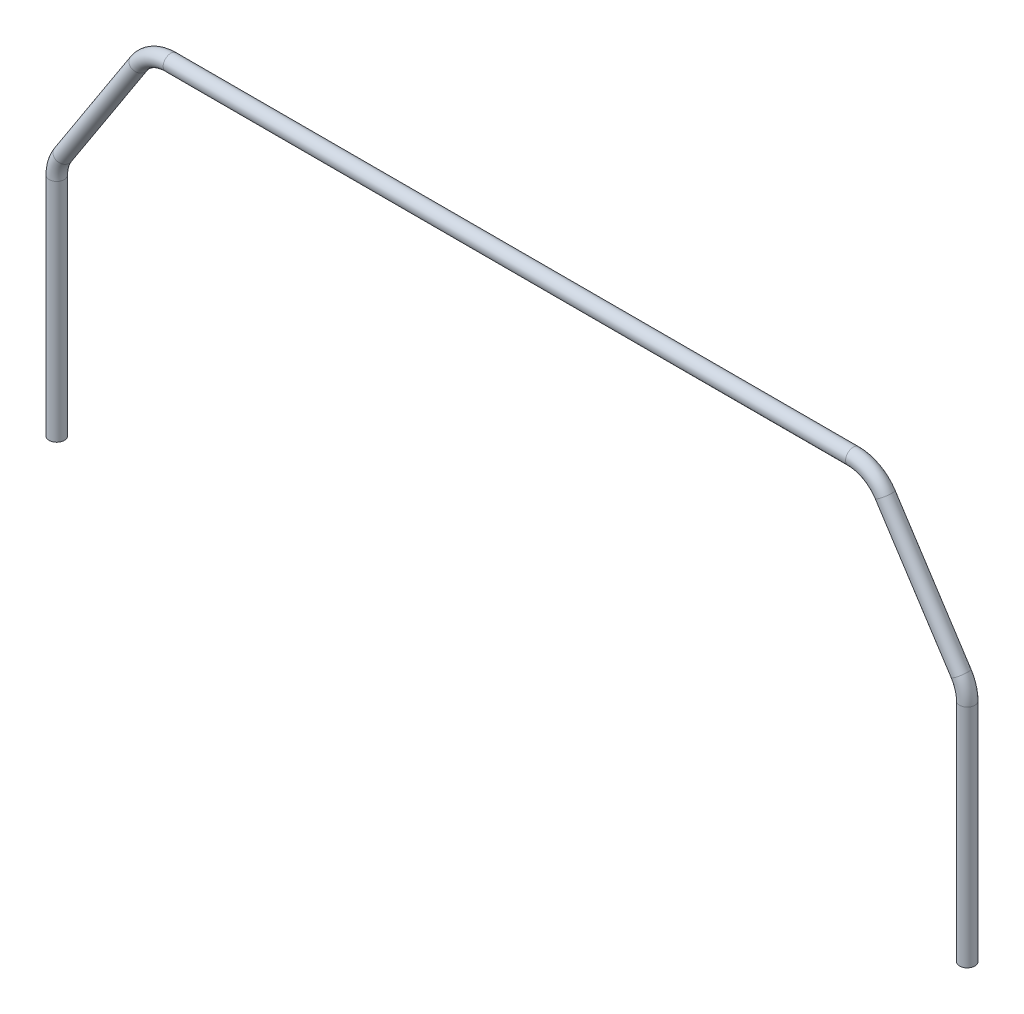
ISO-10303-21;
HEADER;
FILE_DESCRIPTION(('STEP AP214'),'2;1');
FILE_NAME('part.step','',(''),(''),'','','');
FILE_SCHEMA(('AUTOMOTIVE_DESIGN { 1 0 10303 214 1 1 1 1 }'));
ENDSEC;
DATA;
#1=APPLICATION_CONTEXT('core data for automotive mechanical design processes');
#2=APPLICATION_PROTOCOL_DEFINITION('international standard','automotive_design',2000,#1);
#3=PRODUCT_CONTEXT('',#1,'mechanical');
#4=PRODUCT('Part','Part','',(#3));
#5=PRODUCT_RELATED_PRODUCT_CATEGORY('part','',(#4));
#6=PRODUCT_DEFINITION_FORMATION('','',#4);
#7=PRODUCT_DEFINITION_CONTEXT('part definition',#1,'design');
#8=PRODUCT_DEFINITION('design','',#6,#7);
#9=PRODUCT_DEFINITION_SHAPE('','',#8);
#10=(LENGTH_UNIT() NAMED_UNIT(*) SI_UNIT(.MILLI.,.METRE.));
#11=(NAMED_UNIT(*) PLANE_ANGLE_UNIT() SI_UNIT($,.RADIAN.));
#12=(NAMED_UNIT(*) SI_UNIT($,.STERADIAN.) SOLID_ANGLE_UNIT());
#13=UNCERTAINTY_MEASURE_WITH_UNIT(LENGTH_MEASURE(1.E-05),#10,'distance_accuracy_value','');
#14=(GEOMETRIC_REPRESENTATION_CONTEXT(3) GLOBAL_UNCERTAINTY_ASSIGNED_CONTEXT((#13)) GLOBAL_UNIT_ASSIGNED_CONTEXT((#10,
#11,#12)) REPRESENTATION_CONTEXT('',''));
#15=CARTESIAN_POINT('',(0.,0.,0.));
#16=DIRECTION('',(0.,0.,1.));
#17=DIRECTION('',(1.,0.,0.));
#18=AXIS2_PLACEMENT_3D('',#15,#16,#17);
#19=CARTESIAN_POINT('',(-119.5,-10.,0.));
#20=DIRECTION('',(0.,-1.,0.));
#21=DIRECTION('',(0.,0.,1.));
#22=AXIS2_PLACEMENT_3D('',#19,#20,#21);
#23=PLANE('',#22);
#24=CARTESIAN_POINT('',(-119.5,-10.,0.));
#25=DIRECTION('',(0.,-1.,0.));
#26=DIRECTION('',(0.,0.,1.));
#27=AXIS2_PLACEMENT_3D('',#24,#25,#26);
#28=CIRCLE('',#27,2.);
#29=CARTESIAN_POINT('',(-119.5,-10.,2.));
#30=VERTEX_POINT('',#29);
#31=EDGE_CURVE('E96',#30,#30,#28,.T.);
#32=ORIENTED_EDGE('',*,*,#31,.T.);
#33=EDGE_LOOP('',(#32));
#34=FACE_BOUND('',#33,.T.);
#35=ADVANCED_FACE('F53',(#34),#23,.T.);
#36=CARTESIAN_POINT('',(119.5,-10.,0.));
#37=DIRECTION('',(0.,1.,0.));
#38=DIRECTION('',(0.,0.,1.));
#39=AXIS2_PLACEMENT_3D('',#36,#37,#38);
#40=PLANE('',#39);
#41=CARTESIAN_POINT('',(119.5,-10.,0.));
#42=DIRECTION('',(0.,1.,0.));
#43=DIRECTION('',(0.,0.,1.));
#44=AXIS2_PLACEMENT_3D('',#41,#42,#43);
#45=CIRCLE('',#44,2.);
#46=CARTESIAN_POINT('',(119.5,-10.,2.));
#47=VERTEX_POINT('',#46);
#48=EDGE_CURVE('E11',#47,#47,#45,.T.);
#49=ORIENTED_EDGE('',*,*,#48,.F.);
#50=EDGE_LOOP('',(#49));
#51=FACE_BOUND('',#50,.T.);
#52=ADVANCED_FACE('F105',(#51),#40,.F.);
#53=CARTESIAN_POINT('',(-119.5,-10.,0.));
#54=DIRECTION('',(0.,1.,0.));
#55=DIRECTION('',(0.,0.,1.));
#56=AXIS2_PLACEMENT_3D('',#53,#54,#55);
#57=CYLINDRICAL_SURFACE('',#56,2.);
#58=CARTESIAN_POINT('',(-119.5,49.2932661161996,0.));
#59=DIRECTION('',(0.,-1.,0.));
#60=DIRECTION('',(0.,0.,1.));
#61=AXIS2_PLACEMENT_3D('',#58,#59,#60);
#62=CIRCLE('',#61,2.);
#63=CARTESIAN_POINT('',(-121.5,49.2932661161996,0.));
#64=VERTEX_POINT('',#63);
#65=EDGE_CURVE('E92',#64,#64,#62,.T.);
#66=ORIENTED_EDGE('',*,*,#65,.T.);
#67=EDGE_LOOP('',(#66));
#68=FACE_BOUND('',#67,.T.);
#69=ORIENTED_EDGE('',*,*,#31,.F.);
#70=EDGE_LOOP('',(#69));
#71=FACE_BOUND('',#70,.T.);
#72=ADVANCED_FACE('F102',(#68,#71),#57,.T.);
#73=CARTESIAN_POINT('',(-109.5,49.2932661161996,0.));
#74=DIRECTION('',(0.,0.,-1.));
#75=DIRECTION('',(-1.,0.,0.));
#76=AXIS2_PLACEMENT_3D('',#73,#74,#75);
#77=TOROIDAL_SURFACE('',#76,10.,2.);
#78=CARTESIAN_POINT('',(-117.887969044492,54.737710560644,0.));
#79=DIRECTION('',(-0.544444444444445,-0.838796904449211,0.));
#80=DIRECTION('',(0.,0.,1.));
#81=AXIS2_PLACEMENT_3D('',#78,#79,#80);
#82=CIRCLE('',#81,2.);
#83=CARTESIAN_POINT('',(-119.565562853391,55.8265994495329,0.));
#84=VERTEX_POINT('',#83);
#85=EDGE_CURVE('E88',#84,#84,#82,.T.);
#86=CARTESIAN_POINT('',(-109.5,49.2932661161996,0.));
#87=DIRECTION('',(0.,0.,-1.));
#88=DIRECTION('',(-1.,0.,0.));
#89=AXIS2_PLACEMENT_3D('',#86,#87,#88);
#90=CIRCLE('',#89,12.);
#91=EDGE_CURVE('',#64,#84,#90,.T.);
#92=ORIENTED_EDGE('',*,*,#65,.F.);
#93=ORIENTED_EDGE('',*,*,#85,.T.);
#94=ORIENTED_EDGE('',*,*,#91,.T.);
#95=ORIENTED_EDGE('',*,*,#91,.F.);
#96=EDGE_LOOP('',(#92,#94,#93,#95));
#97=FACE_BOUND('',#96,.T.);
#98=ADVANCED_FACE('F104',(#97),#77,.T.);
#99=CARTESIAN_POINT('',(-117.887969044492,54.737710560644,0.));
#100=DIRECTION('',(0.544444444444445,0.838796904449211,0.));
#101=DIRECTION('',(-0.838796904449212,0.544444444444445,0.));
#102=AXIS2_PLACEMENT_3D('',#99,#100,#101);
#103=CYLINDRICAL_SURFACE('',#102,2.);
#104=CARTESIAN_POINT('',(-97.9569099509361,85.4444444444444,0.));
#105=DIRECTION('',(-0.544444444444445,-0.838796904449211,0.));
#106=DIRECTION('',(0.,0.,1.));
#107=AXIS2_PLACEMENT_3D('',#104,#105,#106);
#108=CIRCLE('',#107,2.);
#109=CARTESIAN_POINT('',(-99.6345037598345,86.5333333333333,0.));
#110=VERTEX_POINT('',#109);
#111=EDGE_CURVE('E84',#110,#110,#108,.T.);
#112=ORIENTED_EDGE('',*,*,#111,.T.);
#113=EDGE_LOOP('',(#112));
#114=FACE_BOUND('',#113,.T.);
#115=ORIENTED_EDGE('',*,*,#85,.F.);
#116=EDGE_LOOP('',(#115));
#117=FACE_BOUND('',#116,.T.);
#118=ADVANCED_FACE('F112',(#114,#117),#103,.T.);
#119=CARTESIAN_POINT('',(-89.568940906444,80.,0.));
#120=DIRECTION('',(0.,0.,-1.));
#121=DIRECTION('',(-1.,0.,0.));
#122=AXIS2_PLACEMENT_3D('',#119,#120,#121);
#123=TOROIDAL_SURFACE('',#122,9.99999999999998,2.);
#124=CARTESIAN_POINT('',(-89.568940906444,90.,0.));
#125=DIRECTION('',(-1.,0.,0.));
#126=DIRECTION('',(0.,0.,1.));
#127=AXIS2_PLACEMENT_3D('',#124,#125,#126);
#128=CIRCLE('',#127,2.);
#129=CARTESIAN_POINT('',(-89.568940906444,92.,0.));
#130=VERTEX_POINT('',#129);
#131=EDGE_CURVE('E80',#130,#130,#128,.T.);
#132=CARTESIAN_POINT('',(-89.568940906444,80.,0.));
#133=DIRECTION('',(0.,0.,-1.));
#134=DIRECTION('',(-1.,0.,0.));
#135=AXIS2_PLACEMENT_3D('',#132,#133,#134);
#136=CIRCLE('',#135,12.);
#137=EDGE_CURVE('',#110,#130,#136,.T.);
#138=ORIENTED_EDGE('',*,*,#111,.F.);
#139=ORIENTED_EDGE('',*,*,#131,.T.);
#140=ORIENTED_EDGE('',*,*,#137,.T.);
#141=ORIENTED_EDGE('',*,*,#137,.F.);
#142=EDGE_LOOP('',(#138,#140,#139,#141));
#143=FACE_BOUND('',#142,.T.);
#144=ADVANCED_FACE('F137',(#143),#123,.T.);
#145=CARTESIAN_POINT('',(-89.568940906444,90.,0.));
#146=DIRECTION('',(1.,0.,0.));
#147=DIRECTION('',(0.,0.,-1.));
#148=AXIS2_PLACEMENT_3D('',#145,#146,#147);
#149=CYLINDRICAL_SURFACE('',#148,2.);
#150=CARTESIAN_POINT('',(89.5689409064439,90.,0.));
#151=DIRECTION('',(-1.,0.,0.));
#152=DIRECTION('',(0.,0.,1.));
#153=AXIS2_PLACEMENT_3D('',#150,#151,#152);
#154=CIRCLE('',#153,2.);
#155=CARTESIAN_POINT('',(89.5689409064439,92.,0.));
#156=VERTEX_POINT('',#155);
#157=EDGE_CURVE('E76',#156,#156,#154,.T.);
#158=ORIENTED_EDGE('',*,*,#157,.T.);
#159=EDGE_LOOP('',(#158));
#160=FACE_BOUND('',#159,.T.);
#161=ORIENTED_EDGE('',*,*,#131,.F.);
#162=EDGE_LOOP('',(#161));
#163=FACE_BOUND('',#162,.T.);
#164=ADVANCED_FACE('F133',(#160,#163),#149,.T.);
#165=CARTESIAN_POINT('',(89.568940906444,80.,0.));
#166=DIRECTION('',(0.,0.,-1.));
#167=DIRECTION('',(-1.,0.,0.));
#168=AXIS2_PLACEMENT_3D('',#165,#166,#167);
#169=TOROIDAL_SURFACE('',#168,9.99999999999998,2.);
#170=CARTESIAN_POINT('',(97.9569099509361,85.4444444444444,0.));
#171=DIRECTION('',(-0.544444444444445,0.838796904449212,0.));
#172=DIRECTION('',(0.,0.,1.));
#173=AXIS2_PLACEMENT_3D('',#170,#171,#172);
#174=CIRCLE('',#173,2.);
#175=CARTESIAN_POINT('',(99.6345037598345,86.5333333333333,0.));
#176=VERTEX_POINT('',#175);
#177=EDGE_CURVE('E70',#176,#176,#174,.T.);
#178=CARTESIAN_POINT('',(89.568940906444,80.,0.));
#179=DIRECTION('',(0.,0.,-1.));
#180=DIRECTION('',(-1.,0.,0.));
#181=AXIS2_PLACEMENT_3D('',#178,#179,#180);
#182=CIRCLE('',#181,12.);
#183=EDGE_CURVE('',#156,#176,#182,.T.);
#184=ORIENTED_EDGE('',*,*,#157,.F.);
#185=ORIENTED_EDGE('',*,*,#177,.T.);
#186=ORIENTED_EDGE('',*,*,#183,.T.);
#187=ORIENTED_EDGE('',*,*,#183,.F.);
#188=EDGE_LOOP('',(#184,#186,#185,#187));
#189=FACE_BOUND('',#188,.T.);
#190=ADVANCED_FACE('F129',(#189),#169,.T.);
#191=CARTESIAN_POINT('',(97.9569099509361,85.4444444444444,0.));
#192=DIRECTION('',(0.544444444444445,-0.838796904449211,0.));
#193=DIRECTION('',(0.838796904449211,0.544444444444445,0.));
#194=AXIS2_PLACEMENT_3D('',#191,#192,#193);
#195=CYLINDRICAL_SURFACE('',#194,2.);
#196=CARTESIAN_POINT('',(117.887969044492,54.737710560644,0.));
#197=DIRECTION('',(-0.544444444444445,0.838796904449211,0.));
#198=DIRECTION('',(0.,0.,1.));
#199=AXIS2_PLACEMENT_3D('',#196,#197,#198);
#200=CIRCLE('',#199,2.);
#201=CARTESIAN_POINT('',(119.565562853391,55.8265994495329,0.));
#202=VERTEX_POINT('',#201);
#203=EDGE_CURVE('E65',#202,#202,#200,.T.);
#204=ORIENTED_EDGE('',*,*,#203,.T.);
#205=EDGE_LOOP('',(#204));
#206=FACE_BOUND('',#205,.T.);
#207=ORIENTED_EDGE('',*,*,#177,.F.);
#208=EDGE_LOOP('',(#207));
#209=FACE_BOUND('',#208,.T.);
#210=ADVANCED_FACE('F123',(#206,#209),#195,.T.);
#211=CARTESIAN_POINT('',(109.5,49.2932661161996,0.));
#212=DIRECTION('',(0.,0.,-1.));
#213=DIRECTION('',(-1.,0.,0.));
#214=AXIS2_PLACEMENT_3D('',#211,#212,#213);
#215=TOROIDAL_SURFACE('',#214,10.,2.);
#216=CARTESIAN_POINT('',(119.5,49.2932661161996,0.));
#217=DIRECTION('',(0.,1.,0.));
#218=DIRECTION('',(0.,0.,1.));
#219=AXIS2_PLACEMENT_3D('',#216,#217,#218);
#220=CIRCLE('',#219,2.);
#221=CARTESIAN_POINT('',(121.5,49.2932661161996,0.));
#222=VERTEX_POINT('',#221);
#223=EDGE_CURVE('E60',#222,#222,#220,.T.);
#224=CARTESIAN_POINT('',(109.5,49.2932661161996,0.));
#225=DIRECTION('',(0.,0.,-1.));
#226=DIRECTION('',(-1.,0.,0.));
#227=AXIS2_PLACEMENT_3D('',#224,#225,#226);
#228=CIRCLE('',#227,12.);
#229=EDGE_CURVE('',#202,#222,#228,.T.);
#230=ORIENTED_EDGE('',*,*,#203,.F.);
#231=ORIENTED_EDGE('',*,*,#223,.T.);
#232=ORIENTED_EDGE('',*,*,#229,.T.);
#233=ORIENTED_EDGE('',*,*,#229,.F.);
#234=EDGE_LOOP('',(#230,#232,#231,#233));
#235=FACE_BOUND('',#234,.T.);
#236=ADVANCED_FACE('F118',(#235),#215,.T.);
#237=CARTESIAN_POINT('',(119.5,49.2932661161996,0.));
#238=DIRECTION('',(0.,-1.,0.));
#239=DIRECTION('',(0.,0.,-1.));
#240=AXIS2_PLACEMENT_3D('',#237,#238,#239);
#241=CYLINDRICAL_SURFACE('',#240,2.);
#242=ORIENTED_EDGE('',*,*,#48,.T.);
#243=EDGE_LOOP('',(#242));
#244=FACE_BOUND('',#243,.T.);
#245=ORIENTED_EDGE('',*,*,#223,.F.);
#246=EDGE_LOOP('',(#245));
#247=FACE_BOUND('',#246,.T.);
#248=ADVANCED_FACE('F116',(#244,#247),#241,.T.);
#249=CLOSED_SHELL('',(#35,#52,#72,#98,#118,#144,#164,#190,#210,#236,#248));
#250=MANIFOLD_SOLID_BREP('B2',#249);
#251=ADVANCED_BREP_SHAPE_REPRESENTATION('',(#18,#250),#14);
#252=SHAPE_DEFINITION_REPRESENTATION(#9,#251);
ENDSEC;
END-ISO-10303-21;
